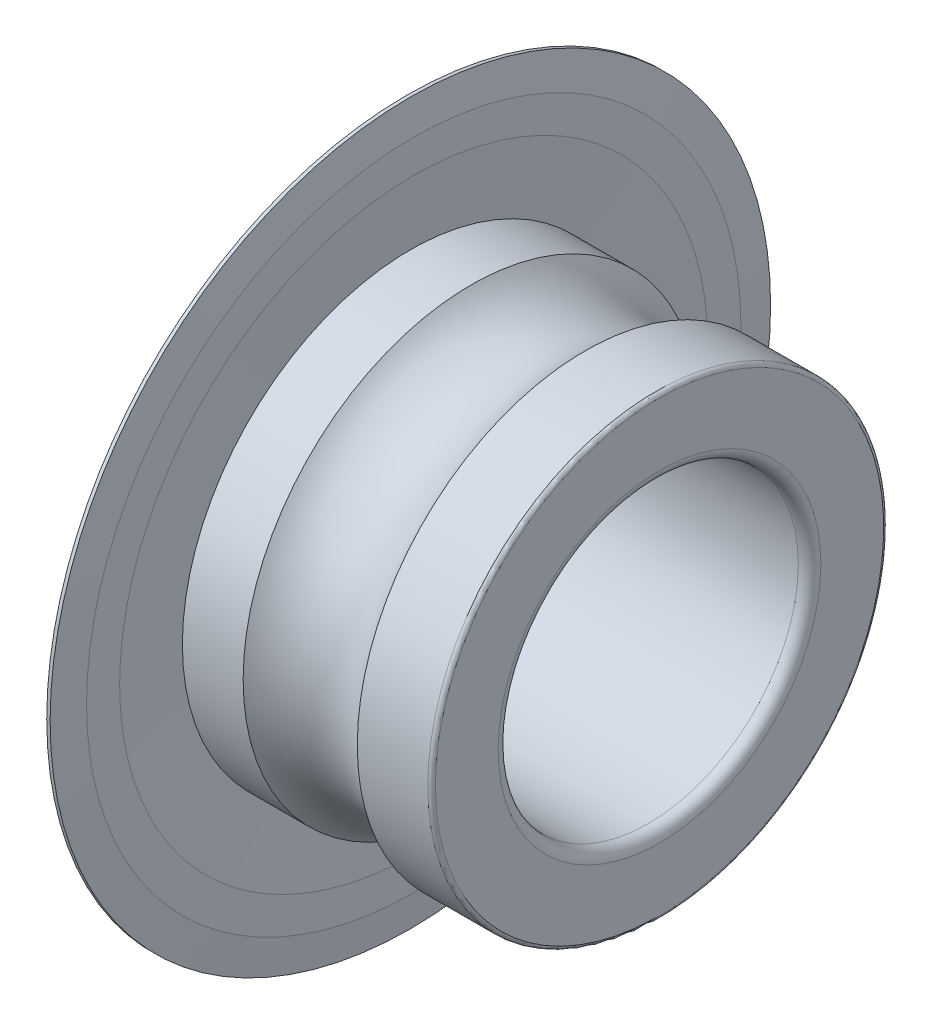
ISO-10303-21;
HEADER;
FILE_DESCRIPTION(('STEP AP214'),'2;1');
FILE_NAME('part.step','',(''),(''),'','','');
FILE_SCHEMA(('AUTOMOTIVE_DESIGN { 1 0 10303 214 1 1 1 1 }'));
ENDSEC;
DATA;
#1=APPLICATION_CONTEXT('core data for automotive mechanical design processes');
#2=APPLICATION_PROTOCOL_DEFINITION('international standard','automotive_design',2000,#1);
#3=PRODUCT_CONTEXT('',#1,'mechanical');
#4=PRODUCT('Part','Part','',(#3));
#5=PRODUCT_RELATED_PRODUCT_CATEGORY('part','',(#4));
#6=PRODUCT_DEFINITION_FORMATION('','',#4);
#7=PRODUCT_DEFINITION_CONTEXT('part definition',#1,'design');
#8=PRODUCT_DEFINITION('design','',#6,#7);
#9=PRODUCT_DEFINITION_SHAPE('','',#8);
#10=(LENGTH_UNIT() NAMED_UNIT(*) SI_UNIT(.MILLI.,.METRE.));
#11=(NAMED_UNIT(*) PLANE_ANGLE_UNIT() SI_UNIT($,.RADIAN.));
#12=(NAMED_UNIT(*) SI_UNIT($,.STERADIAN.) SOLID_ANGLE_UNIT());
#13=UNCERTAINTY_MEASURE_WITH_UNIT(LENGTH_MEASURE(1.E-05),#10,'distance_accuracy_value','');
#14=(GEOMETRIC_REPRESENTATION_CONTEXT(3) GLOBAL_UNCERTAINTY_ASSIGNED_CONTEXT((#13)) GLOBAL_UNIT_ASSIGNED_CONTEXT((#10,
#11,#12)) REPRESENTATION_CONTEXT('',''));
#15=CARTESIAN_POINT('',(0.,0.,0.));
#16=DIRECTION('',(0.,0.,1.));
#17=DIRECTION('',(1.,0.,0.));
#18=AXIS2_PLACEMENT_3D('',#15,#16,#17);
#19=CARTESIAN_POINT('',(50.,0.,0.));
#20=DIRECTION('',(-1.,0.,0.));
#21=DIRECTION('',(0.,0.,1.));
#22=AXIS2_PLACEMENT_3D('',#19,#20,#21);
#23=CYLINDRICAL_SURFACE('',#22,6.075);
#24=CARTESIAN_POINT('',(0.100000000000003,0.,0.));
#25=DIRECTION('',(-1.,0.,0.));
#26=DIRECTION('',(0.,0.,1.));
#27=AXIS2_PLACEMENT_3D('',#24,#25,#26);
#28=CIRCLE('',#27,6.075);
#29=CARTESIAN_POINT('',(0.100000000000003,0.,6.075));
#30=VERTEX_POINT('',#29);
#31=EDGE_CURVE('E72',#30,#30,#28,.T.);
#32=ORIENTED_EDGE('',*,*,#31,.F.);
#33=EDGE_LOOP('',(#32));
#34=FACE_BOUND('',#33,.T.);
#35=CARTESIAN_POINT('',(0.269999999999999,0.,0.));
#36=DIRECTION('',(1.,0.,0.));
#37=DIRECTION('',(0.,0.,-1.));
#38=AXIS2_PLACEMENT_3D('',#35,#36,#37);
#39=CIRCLE('',#38,6.075);
#40=CARTESIAN_POINT('',(0.269999999999999,0.,-6.075));
#41=VERTEX_POINT('',#40);
#42=EDGE_CURVE('E10',#41,#41,#39,.T.);
#43=ORIENTED_EDGE('',*,*,#42,.F.);
#44=EDGE_LOOP('',(#43));
#45=FACE_BOUND('',#44,.T.);
#46=ADVANCED_FACE('F31',(#34,#45),#23,.T.);
#47=CARTESIAN_POINT('',(1.979271473931,0.,0.));
#48=DIRECTION('',(-1.,0.,0.));
#49=DIRECTION('',(0.,0.,1.));
#50=AXIS2_PLACEMENT_3D('',#47,#48,#49);
#51=CIRCLE('',#50,6.075);
#52=CARTESIAN_POINT('',(1.979271473931,0.,6.075));
#53=VERTEX_POINT('',#52);
#54=EDGE_CURVE('E69',#53,#53,#51,.T.);
#55=ORIENTED_EDGE('',*,*,#54,.T.);
#56=EDGE_LOOP('',(#55));
#57=FACE_BOUND('',#56,.T.);
#58=CARTESIAN_POINT('',(0.359999999999999,0.,0.));
#59=DIRECTION('',(1.,0.,0.));
#60=DIRECTION('',(0.,0.,-1.));
#61=AXIS2_PLACEMENT_3D('',#58,#59,#60);
#62=CIRCLE('',#61,6.075);
#63=CARTESIAN_POINT('',(0.359999999999999,0.,-6.075));
#64=VERTEX_POINT('',#63);
#65=EDGE_CURVE('E38',#64,#64,#62,.F.);
#66=ORIENTED_EDGE('',*,*,#65,.F.);
#67=EDGE_LOOP('',(#66));
#68=FACE_BOUND('',#67,.T.);
#69=ADVANCED_FACE('F118',(#57,#68),#23,.T.);
#70=CARTESIAN_POINT('',(0.0999999999999214,0.,0.));
#71=DIRECTION('',(-1.,0.,0.));
#72=DIRECTION('',(0.,0.,1.));
#73=AXIS2_PLACEMENT_3D('',#70,#71,#72);
#74=TOROIDAL_SURFACE('',#73,5.97500000000008,0.0999999999999213);
#75=CARTESIAN_POINT('',(0.,0.,0.));
#76=DIRECTION('',(-1.,0.,0.));
#77=DIRECTION('',(0.,0.,1.));
#78=AXIS2_PLACEMENT_3D('',#75,#76,#77);
#79=CIRCLE('',#78,5.975);
#80=CARTESIAN_POINT('',(0.,0.,5.975));
#81=VERTEX_POINT('',#80);
#82=EDGE_CURVE('E42',#81,#81,#79,.T.);
#83=ORIENTED_EDGE('',*,*,#82,.F.);
#84=EDGE_LOOP('',(#83));
#85=FACE_BOUND('',#84,.T.);
#86=ORIENTED_EDGE('',*,*,#31,.T.);
#87=EDGE_LOOP('',(#86));
#88=FACE_BOUND('',#87,.T.);
#89=ADVANCED_FACE('F33',(#85,#88),#74,.T.);
#90=CARTESIAN_POINT('',(0.,5.975,0.));
#91=DIRECTION('',(1.,0.,0.));
#92=DIRECTION('',(0.,0.,-1.));
#93=AXIS2_PLACEMENT_3D('',#90,#91,#92);
#94=PLANE('',#93);
#95=CARTESIAN_POINT('',(0.,0.,0.));
#96=DIRECTION('',(-1.,0.,0.));
#97=DIRECTION('',(0.,0.,1.));
#98=AXIS2_PLACEMENT_3D('',#95,#96,#97);
#99=CIRCLE('',#98,4.3);
#100=CARTESIAN_POINT('',(0.,0.,4.3));
#101=VERTEX_POINT('',#100);
#102=EDGE_CURVE('E46',#101,#101,#99,.T.);
#103=ORIENTED_EDGE('',*,*,#102,.F.);
#104=EDGE_LOOP('',(#103));
#105=FACE_BOUND('',#104,.T.);
#106=ORIENTED_EDGE('',*,*,#82,.T.);
#107=EDGE_LOOP('',(#106));
#108=FACE_BOUND('',#107,.T.);
#109=ADVANCED_FACE('F156',(#105,#108),#94,.F.);
#110=CARTESIAN_POINT('',(0.299999999999939,0.,0.));
#111=DIRECTION('',(-1.,0.,0.));
#112=DIRECTION('',(0.,0.,1.));
#113=AXIS2_PLACEMENT_3D('',#110,#111,#112);
#114=TOROIDAL_SURFACE('',#113,4.29999999999994,0.299999999999939);
#115=CARTESIAN_POINT('',(0.300000000000002,0.,0.));
#116=DIRECTION('',(-1.,0.,0.));
#117=DIRECTION('',(0.,0.,1.));
#118=AXIS2_PLACEMENT_3D('',#115,#116,#117);
#119=CIRCLE('',#118,4.);
#120=CARTESIAN_POINT('',(0.300000000000002,0.,4.));
#121=VERTEX_POINT('',#120);
#122=EDGE_CURVE('E51',#121,#121,#119,.T.);
#123=ORIENTED_EDGE('',*,*,#122,.F.);
#124=EDGE_LOOP('',(#123));
#125=FACE_BOUND('',#124,.T.);
#126=ORIENTED_EDGE('',*,*,#102,.T.);
#127=EDGE_LOOP('',(#126));
#128=FACE_BOUND('',#127,.T.);
#129=ADVANCED_FACE('F153',(#125,#128),#114,.T.);
#130=CARTESIAN_POINT('',(50.,0.,0.));
#131=DIRECTION('',(-1.,0.,0.));
#132=DIRECTION('',(0.,0.,1.));
#133=AXIS2_PLACEMENT_3D('',#130,#131,#132);
#134=CYLINDRICAL_SURFACE('',#133,4.);
#135=CARTESIAN_POINT('',(6.7,0.,0.));
#136=DIRECTION('',(-1.,0.,0.));
#137=DIRECTION('',(0.,0.,1.));
#138=AXIS2_PLACEMENT_3D('',#135,#136,#137);
#139=CIRCLE('',#138,4.);
#140=CARTESIAN_POINT('',(6.7,0.,4.));
#141=VERTEX_POINT('',#140);
#142=EDGE_CURVE('E54',#141,#141,#139,.T.);
#143=ORIENTED_EDGE('',*,*,#142,.F.);
#144=EDGE_LOOP('',(#143));
#145=FACE_BOUND('',#144,.T.);
#146=ORIENTED_EDGE('',*,*,#122,.T.);
#147=EDGE_LOOP('',(#146));
#148=FACE_BOUND('',#147,.T.);
#149=ADVANCED_FACE('F149',(#145,#148),#134,.F.);
#150=CARTESIAN_POINT('',(6.70000000000012,0.,0.));
#151=DIRECTION('',(-1.,0.,0.));
#152=DIRECTION('',(0.,0.,1.));
#153=AXIS2_PLACEMENT_3D('',#150,#151,#152);
#154=TOROIDAL_SURFACE('',#153,4.29999999999988,0.299999999999878);
#155=CARTESIAN_POINT('',(7.,0.,0.));
#156=DIRECTION('',(-1.,0.,0.));
#157=DIRECTION('',(0.,0.,1.));
#158=AXIS2_PLACEMENT_3D('',#155,#156,#157);
#159=CIRCLE('',#158,4.29999999999988);
#160=CARTESIAN_POINT('',(7.,0.,4.29999999999988));
#161=VERTEX_POINT('',#160);
#162=EDGE_CURVE('E57',#161,#161,#159,.T.);
#163=ORIENTED_EDGE('',*,*,#162,.F.);
#164=EDGE_LOOP('',(#163));
#165=FACE_BOUND('',#164,.T.);
#166=ORIENTED_EDGE('',*,*,#142,.T.);
#167=EDGE_LOOP('',(#166));
#168=FACE_BOUND('',#167,.T.);
#169=ADVANCED_FACE('F145',(#165,#168),#154,.T.);
#170=CARTESIAN_POINT('',(7.,4.3,0.));
#171=DIRECTION('',(-1.,0.,0.));
#172=DIRECTION('',(0.,0.,1.));
#173=AXIS2_PLACEMENT_3D('',#170,#171,#172);
#174=PLANE('',#173);
#175=CARTESIAN_POINT('',(7.,0.,0.));
#176=DIRECTION('',(-1.,0.,0.));
#177=DIRECTION('',(0.,0.,1.));
#178=AXIS2_PLACEMENT_3D('',#175,#176,#177);
#179=CIRCLE('',#178,5.975);
#180=CARTESIAN_POINT('',(7.,0.,5.975));
#181=VERTEX_POINT('',#180);
#182=EDGE_CURVE('E60',#181,#181,#179,.T.);
#183=ORIENTED_EDGE('',*,*,#182,.F.);
#184=EDGE_LOOP('',(#183));
#185=FACE_BOUND('',#184,.T.);
#186=ORIENTED_EDGE('',*,*,#162,.T.);
#187=EDGE_LOOP('',(#186));
#188=FACE_BOUND('',#187,.T.);
#189=ADVANCED_FACE('F141',(#185,#188),#174,.F.);
#190=CARTESIAN_POINT('',(6.90000000000015,0.,0.));
#191=DIRECTION('',(-1.,0.,0.));
#192=DIRECTION('',(0.,0.,1.));
#193=AXIS2_PLACEMENT_3D('',#190,#191,#192);
#194=TOROIDAL_SURFACE('',#193,5.97500000000016,0.099999999999845);
#195=CARTESIAN_POINT('',(6.9,0.,0.));
#196=DIRECTION('',(-1.,0.,0.));
#197=DIRECTION('',(0.,0.,1.));
#198=AXIS2_PLACEMENT_3D('',#195,#196,#197);
#199=CIRCLE('',#198,6.075);
#200=CARTESIAN_POINT('',(6.9,0.,6.075));
#201=VERTEX_POINT('',#200);
#202=EDGE_CURVE('E63',#201,#201,#199,.T.);
#203=ORIENTED_EDGE('',*,*,#202,.F.);
#204=EDGE_LOOP('',(#203));
#205=FACE_BOUND('',#204,.T.);
#206=ORIENTED_EDGE('',*,*,#182,.T.);
#207=EDGE_LOOP('',(#206));
#208=FACE_BOUND('',#207,.T.);
#209=ADVANCED_FACE('F137',(#205,#208),#194,.T.);
#210=CARTESIAN_POINT('',(50.,0.,0.));
#211=DIRECTION('',(-1.,0.,0.));
#212=DIRECTION('',(0.,0.,1.));
#213=AXIS2_PLACEMENT_3D('',#210,#211,#212);
#214=CYLINDRICAL_SURFACE('',#213,6.075);
#215=CARTESIAN_POINT('',(5.020728526069,0.,0.));
#216=DIRECTION('',(-1.,0.,0.));
#217=DIRECTION('',(0.,0.,1.));
#218=AXIS2_PLACEMENT_3D('',#215,#216,#217);
#219=CIRCLE('',#218,6.075);
#220=CARTESIAN_POINT('',(5.020728526069,0.,6.075));
#221=VERTEX_POINT('',#220);
#222=EDGE_CURVE('E66',#221,#221,#219,.T.);
#223=ORIENTED_EDGE('',*,*,#222,.F.);
#224=EDGE_LOOP('',(#223));
#225=FACE_BOUND('',#224,.T.);
#226=ORIENTED_EDGE('',*,*,#202,.T.);
#227=EDGE_LOOP('',(#226));
#228=FACE_BOUND('',#227,.T.);
#229=ADVANCED_FACE('F133',(#225,#228),#214,.T.);
#230=CARTESIAN_POINT('',(3.5,0.,0.));
#231=DIRECTION('',(-1.,0.,0.));
#232=DIRECTION('',(0.,0.,1.));
#233=AXIS2_PLACEMENT_3D('',#230,#231,#232);
#234=TOROIDAL_SURFACE('',#233,7.35,1.9845);
#235=ORIENTED_EDGE('',*,*,#54,.F.);
#236=EDGE_LOOP('',(#235));
#237=FACE_BOUND('',#236,.T.);
#238=ORIENTED_EDGE('',*,*,#222,.T.);
#239=EDGE_LOOP('',(#238));
#240=FACE_BOUND('',#239,.T.);
#241=ADVANCED_FACE('F130',(#237,#240),#234,.F.);
#242=CARTESIAN_POINT('',(50.,0.,0.));
#243=DIRECTION('',(-1.,0.,0.));
#244=DIRECTION('',(0.,0.,1.));
#245=AXIS2_PLACEMENT_3D('',#242,#243,#244);
#246=CYLINDRICAL_SURFACE('',#245,9.6);
#247=CARTESIAN_POINT('',(0.269999999999999,0.,0.));
#248=DIRECTION('',(-1.,0.,0.));
#249=DIRECTION('',(0.,0.,1.));
#250=AXIS2_PLACEMENT_3D('',#247,#248,#249);
#251=CIRCLE('',#250,9.6);
#252=CARTESIAN_POINT('',(0.269999999999999,0.,9.6));
#253=VERTEX_POINT('',#252);
#254=EDGE_CURVE('E75',#253,#253,#251,.T.);
#255=ORIENTED_EDGE('',*,*,#254,.F.);
#256=EDGE_LOOP('',(#255));
#257=FACE_BOUND('',#256,.T.);
#258=CARTESIAN_POINT('',(0.359999999999999,0.,0.));
#259=DIRECTION('',(-1.,0.,0.));
#260=DIRECTION('',(0.,0.,1.));
#261=AXIS2_PLACEMENT_3D('',#258,#259,#260);
#262=CIRCLE('',#261,9.6);
#263=CARTESIAN_POINT('',(0.359999999999999,0.,9.6));
#264=VERTEX_POINT('',#263);
#265=EDGE_CURVE('E90',#264,#264,#262,.T.);
#266=ORIENTED_EDGE('',*,*,#265,.T.);
#267=EDGE_LOOP('',(#266));
#268=FACE_BOUND('',#267,.T.);
#269=ADVANCED_FACE('F94',(#257,#268),#246,.T.);
#270=CARTESIAN_POINT('',(0.269999999999999,0.,0.));
#271=DIRECTION('',(-1.,0.,0.));
#272=DIRECTION('',(0.,0.,1.));
#273=AXIS2_PLACEMENT_3D('',#270,#271,#272);
#274=CONICAL_SURFACE('',#273,9.6,1.51977681092792);
#275=CARTESIAN_POINT('',(0.315000000000003,0.,0.));
#276=DIRECTION('',(-1.,0.,0.));
#277=DIRECTION('',(0.,0.,1.));
#278=AXIS2_PLACEMENT_3D('',#275,#276,#277);
#279=CIRCLE('',#278,8.71875);
#280=CARTESIAN_POINT('',(0.315000000000003,0.,8.71875));
#281=VERTEX_POINT('',#280);
#282=EDGE_CURVE('E78',#281,#281,#279,.T.);
#283=ORIENTED_EDGE('',*,*,#282,.F.);
#284=EDGE_LOOP('',(#283));
#285=FACE_BOUND('',#284,.T.);
#286=ORIENTED_EDGE('',*,*,#254,.T.);
#287=EDGE_LOOP('',(#286));
#288=FACE_BOUND('',#287,.T.);
#289=ADVANCED_FACE('F188',(#285,#288),#274,.F.);
#290=CARTESIAN_POINT('',(0.315000000000003,0.,0.));
#291=DIRECTION('',(1.,0.,0.));
#292=DIRECTION('',(0.,0.,-1.));
#293=AXIS2_PLACEMENT_3D('',#290,#291,#292);
#294=CONICAL_SURFACE('',#293,8.71875,1.51977681092792);
#295=CARTESIAN_POINT('',(0.269999999999999,0.,0.));
#296=DIRECTION('',(-1.,0.,0.));
#297=DIRECTION('',(0.,0.,1.));
#298=AXIS2_PLACEMENT_3D('',#295,#296,#297);
#299=CIRCLE('',#298,7.8375);
#300=CARTESIAN_POINT('',(0.269999999999999,0.,7.8375));
#301=VERTEX_POINT('',#300);
#302=EDGE_CURVE('E81',#301,#301,#299,.T.);
#303=ORIENTED_EDGE('',*,*,#302,.F.);
#304=EDGE_LOOP('',(#303));
#305=FACE_BOUND('',#304,.T.);
#306=ORIENTED_EDGE('',*,*,#282,.T.);
#307=EDGE_LOOP('',(#306));
#308=FACE_BOUND('',#307,.T.);
#309=ADVANCED_FACE('F115',(#305,#308),#294,.T.);
#310=CARTESIAN_POINT('',(0.27,7.8375,0.));
#311=DIRECTION('',(1.,0.,0.));
#312=DIRECTION('',(0.,0.,-1.));
#313=AXIS2_PLACEMENT_3D('',#310,#311,#312);
#314=PLANE('',#313);
#315=ORIENTED_EDGE('',*,*,#42,.T.);
#316=EDGE_LOOP('',(#315));
#317=FACE_BOUND('',#316,.T.);
#318=ORIENTED_EDGE('',*,*,#302,.T.);
#319=EDGE_LOOP('',(#318));
#320=FACE_BOUND('',#319,.T.);
#321=ADVANCED_FACE('F110',(#317,#320),#314,.F.);
#322=CARTESIAN_POINT('',(0.359999999999999,0.,0.));
#323=DIRECTION('',(1.,0.,0.));
#324=DIRECTION('',(0.,0.,-1.));
#325=AXIS2_PLACEMENT_3D('',#322,#323,#324);
#326=CONICAL_SURFACE('',#325,6.075,1.51977681092793);
#327=CARTESIAN_POINT('',(0.449999999999999,0.,0.));
#328=DIRECTION('',(-1.,0.,0.));
#329=DIRECTION('',(0.,0.,1.));
#330=AXIS2_PLACEMENT_3D('',#327,#328,#329);
#331=CIRCLE('',#330,7.8375);
#332=CARTESIAN_POINT('',(0.449999999999999,0.,7.8375));
#333=VERTEX_POINT('',#332);
#334=EDGE_CURVE('E84',#333,#333,#331,.T.);
#335=ORIENTED_EDGE('',*,*,#334,.F.);
#336=EDGE_LOOP('',(#335));
#337=FACE_BOUND('',#336,.T.);
#338=ORIENTED_EDGE('',*,*,#65,.T.);
#339=EDGE_LOOP('',(#338));
#340=FACE_BOUND('',#339,.T.);
#341=ADVANCED_FACE('F105',(#337,#340),#326,.F.);
#342=CARTESIAN_POINT('',(0.45,7.8375,0.));
#343=DIRECTION('',(-1.,0.,0.));
#344=DIRECTION('',(0.,0.,1.));
#345=AXIS2_PLACEMENT_3D('',#342,#343,#344);
#346=PLANE('',#345);
#347=CARTESIAN_POINT('',(0.449999999999999,0.,0.));
#348=DIRECTION('',(-1.,0.,0.));
#349=DIRECTION('',(0.,0.,1.));
#350=AXIS2_PLACEMENT_3D('',#347,#348,#349);
#351=CIRCLE('',#350,8.71875);
#352=CARTESIAN_POINT('',(0.449999999999999,0.,8.71875));
#353=VERTEX_POINT('',#352);
#354=EDGE_CURVE('E87',#353,#353,#351,.T.);
#355=ORIENTED_EDGE('',*,*,#354,.F.);
#356=EDGE_LOOP('',(#355));
#357=FACE_BOUND('',#356,.T.);
#358=ORIENTED_EDGE('',*,*,#334,.T.);
#359=EDGE_LOOP('',(#358));
#360=FACE_BOUND('',#359,.T.);
#361=ADVANCED_FACE('F99',(#357,#360),#346,.F.);
#362=CARTESIAN_POINT('',(0.449999999999999,0.,0.));
#363=DIRECTION('',(-1.,0.,0.));
#364=DIRECTION('',(0.,0.,1.));
#365=AXIS2_PLACEMENT_3D('',#362,#363,#364);
#366=CONICAL_SURFACE('',#365,8.71875,1.46902152746005);
#367=ORIENTED_EDGE('',*,*,#265,.F.);
#368=EDGE_LOOP('',(#367));
#369=FACE_BOUND('',#368,.T.);
#370=ORIENTED_EDGE('',*,*,#354,.T.);
#371=EDGE_LOOP('',(#370));
#372=FACE_BOUND('',#371,.T.);
#373=ADVANCED_FACE('F96',(#369,#372),#366,.T.);
#374=CLOSED_SHELL('',(#46,#69,#89,#109,#129,#149,#169,#189,#209,#229,#241,#269,#289,#309,#321,
#341,#361,#373));
#375=MANIFOLD_SOLID_BREP('B2',#374);
#376=ADVANCED_BREP_SHAPE_REPRESENTATION('',(#18,#375),#14);
#377=SHAPE_DEFINITION_REPRESENTATION(#9,#376);
ENDSEC;
END-ISO-10303-21;
